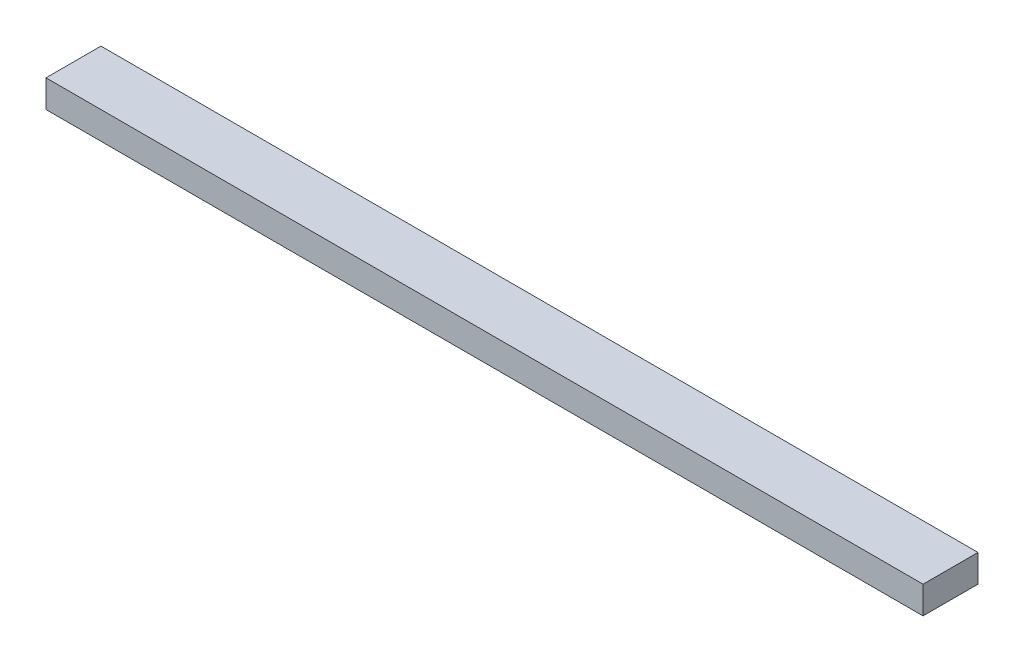
ISO-10303-21;
HEADER;
FILE_DESCRIPTION(('STEP AP214'),'2;1');
FILE_NAME('part.step','',(''),(''),'','','');
FILE_SCHEMA(('AUTOMOTIVE_DESIGN { 1 0 10303 214 1 1 1 1 }'));
ENDSEC;
DATA;
#1=APPLICATION_CONTEXT('core data for automotive mechanical design processes');
#2=APPLICATION_PROTOCOL_DEFINITION('international standard','automotive_design',2000,#1);
#3=PRODUCT_CONTEXT('',#1,'mechanical');
#4=PRODUCT('Part','Part','',(#3));
#5=PRODUCT_RELATED_PRODUCT_CATEGORY('part','',(#4));
#6=PRODUCT_DEFINITION_FORMATION('','',#4);
#7=PRODUCT_DEFINITION_CONTEXT('part definition',#1,'design');
#8=PRODUCT_DEFINITION('design','',#6,#7);
#9=PRODUCT_DEFINITION_SHAPE('','',#8);
#10=(LENGTH_UNIT() NAMED_UNIT(*) SI_UNIT(.MILLI.,.METRE.));
#11=(NAMED_UNIT(*) PLANE_ANGLE_UNIT() SI_UNIT($,.RADIAN.));
#12=(NAMED_UNIT(*) SI_UNIT($,.STERADIAN.) SOLID_ANGLE_UNIT());
#13=UNCERTAINTY_MEASURE_WITH_UNIT(LENGTH_MEASURE(1.E-05),#10,'distance_accuracy_value','');
#14=(GEOMETRIC_REPRESENTATION_CONTEXT(3) GLOBAL_UNCERTAINTY_ASSIGNED_CONTEXT((#13)) GLOBAL_UNIT_ASSIGNED_CONTEXT((#10,
#11,#12)) REPRESENTATION_CONTEXT('',''));
#15=CARTESIAN_POINT('',(0.,0.,0.));
#16=DIRECTION('',(0.,0.,1.));
#17=DIRECTION('',(1.,0.,0.));
#18=AXIS2_PLACEMENT_3D('',#15,#16,#17);
#19=CARTESIAN_POINT('',(0.,19.05,0.));
#20=DIRECTION('',(1.,0.,0.));
#21=DIRECTION('',(0.,0.,-1.));
#22=AXIS2_PLACEMENT_3D('',#19,#20,#21);
#23=PLANE('',#22);
#24=DIRECTION('',(0.,0.,1.));
#25=VECTOR('',#24,1.);
#26=CARTESIAN_POINT('',(0.,0.,0.));
#27=LINE('',#26,#25);
#28=CARTESIAN_POINT('',(0.,0.,-38.1));
#29=VERTEX_POINT('',#28);
#30=CARTESIAN_POINT('',(0.,0.,0.));
#31=VERTEX_POINT('',#30);
#32=EDGE_CURVE('E102',#29,#31,#27,.T.);
#33=ORIENTED_EDGE('',*,*,#32,.T.);
#34=DIRECTION('',(0.,-1.,0.));
#35=VECTOR('',#34,1.);
#36=CARTESIAN_POINT('',(0.,19.05,0.));
#37=LINE('',#36,#35);
#38=CARTESIAN_POINT('',(0.,19.05,0.));
#39=VERTEX_POINT('',#38);
#40=EDGE_CURVE('E11',#39,#31,#37,.T.);
#41=ORIENTED_EDGE('',*,*,#40,.F.);
#42=DIRECTION('',(0.,0.,1.));
#43=VECTOR('',#42,1.);
#44=CARTESIAN_POINT('',(0.,19.05,0.));
#45=LINE('',#44,#43);
#46=CARTESIAN_POINT('',(0.,19.05,-38.1));
#47=VERTEX_POINT('',#46);
#48=EDGE_CURVE('E90',#47,#39,#45,.T.);
#49=ORIENTED_EDGE('',*,*,#48,.F.);
#50=DIRECTION('',(0.,-1.,0.));
#51=VECTOR('',#50,1.);
#52=CARTESIAN_POINT('',(0.,19.05,-38.1));
#53=LINE('',#52,#51);
#54=EDGE_CURVE('E98',#47,#29,#53,.T.);
#55=ORIENTED_EDGE('',*,*,#54,.T.);
#56=EDGE_LOOP('',(#33,#41,#49,#55));
#57=FACE_BOUND('',#56,.T.);
#58=ADVANCED_FACE('F39',(#57),#23,.F.);
#59=CARTESIAN_POINT('',(0.,19.05,0.));
#60=DIRECTION('',(0.,0.,-1.));
#61=DIRECTION('',(-1.,0.,0.));
#62=AXIS2_PLACEMENT_3D('',#59,#60,#61);
#63=PLANE('',#62);
#64=DIRECTION('',(1.,0.,0.));
#65=VECTOR('',#64,1.);
#66=CARTESIAN_POINT('',(0.,0.,0.));
#67=LINE('',#66,#65);
#68=CARTESIAN_POINT('',(608.0125,0.,0.));
#69=VERTEX_POINT('',#68);
#70=EDGE_CURVE('E94',#31,#69,#67,.T.);
#71=ORIENTED_EDGE('',*,*,#70,.T.);
#72=DIRECTION('',(0.,-1.,0.));
#73=VECTOR('',#72,1.);
#74=CARTESIAN_POINT('',(608.0125,19.05,0.));
#75=LINE('',#74,#73);
#76=CARTESIAN_POINT('',(608.0125,19.05,0.));
#77=VERTEX_POINT('',#76);
#78=EDGE_CURVE('E47',#77,#69,#75,.T.);
#79=ORIENTED_EDGE('',*,*,#78,.F.);
#80=DIRECTION('',(1.,0.,0.));
#81=VECTOR('',#80,1.);
#82=CARTESIAN_POINT('',(0.,19.05,0.));
#83=LINE('',#82,#81);
#84=EDGE_CURVE('E85',#39,#77,#83,.T.);
#85=ORIENTED_EDGE('',*,*,#84,.F.);
#86=ORIENTED_EDGE('',*,*,#40,.T.);
#87=EDGE_LOOP('',(#71,#79,#85,#86));
#88=FACE_BOUND('',#87,.T.);
#89=ADVANCED_FACE('F93',(#88),#63,.F.);
#90=CARTESIAN_POINT('',(608.0125,19.05,0.));
#91=DIRECTION('',(-1.,0.,0.));
#92=DIRECTION('',(0.,0.,1.));
#93=AXIS2_PLACEMENT_3D('',#90,#91,#92);
#94=PLANE('',#93);
#95=DIRECTION('',(0.,0.,-1.));
#96=VECTOR('',#95,1.);
#97=CARTESIAN_POINT('',(608.0125,0.,0.));
#98=LINE('',#97,#96);
#99=CARTESIAN_POINT('',(608.0125,0.,-38.1));
#100=VERTEX_POINT('',#99);
#101=EDGE_CURVE('E72',#69,#100,#98,.T.);
#102=ORIENTED_EDGE('',*,*,#101,.T.);
#103=DIRECTION('',(0.,-1.,0.));
#104=VECTOR('',#103,1.);
#105=CARTESIAN_POINT('',(608.0125,19.05,-38.1));
#106=LINE('',#105,#104);
#107=CARTESIAN_POINT('',(608.0125,19.05,-38.1));
#108=VERTEX_POINT('',#107);
#109=EDGE_CURVE('E95',#108,#100,#106,.T.);
#110=ORIENTED_EDGE('',*,*,#109,.F.);
#111=DIRECTION('',(0.,0.,-1.));
#112=VECTOR('',#111,1.);
#113=CARTESIAN_POINT('',(608.0125,19.05,0.));
#114=LINE('',#113,#112);
#115=EDGE_CURVE('E88',#77,#108,#114,.T.);
#116=ORIENTED_EDGE('',*,*,#115,.F.);
#117=ORIENTED_EDGE('',*,*,#78,.T.);
#118=EDGE_LOOP('',(#102,#110,#116,#117));
#119=FACE_BOUND('',#118,.T.);
#120=ADVANCED_FACE('F96',(#119),#94,.F.);
#121=CARTESIAN_POINT('',(0.,19.05,-38.1));
#122=DIRECTION('',(0.,0.,1.));
#123=DIRECTION('',(1.,0.,0.));
#124=AXIS2_PLACEMENT_3D('',#121,#122,#123);
#125=PLANE('',#124);
#126=DIRECTION('',(-1.,0.,0.));
#127=VECTOR('',#126,1.);
#128=CARTESIAN_POINT('',(0.,0.,-38.1));
#129=LINE('',#128,#127);
#130=EDGE_CURVE('E78',#100,#29,#129,.T.);
#131=ORIENTED_EDGE('',*,*,#130,.T.);
#132=ORIENTED_EDGE('',*,*,#54,.F.);
#133=DIRECTION('',(-1.,0.,0.));
#134=VECTOR('',#133,1.);
#135=CARTESIAN_POINT('',(0.,19.05,-38.1));
#136=LINE('',#135,#134);
#137=EDGE_CURVE('E55',#108,#47,#136,.T.);
#138=ORIENTED_EDGE('',*,*,#137,.F.);
#139=ORIENTED_EDGE('',*,*,#109,.T.);
#140=EDGE_LOOP('',(#131,#132,#138,#139));
#141=FACE_BOUND('',#140,.T.);
#142=ADVANCED_FACE('F109',(#141),#125,.F.);
#143=CARTESIAN_POINT('',(0.,19.05,0.));
#144=DIRECTION('',(0.,-1.,0.));
#145=DIRECTION('',(0.,0.,-1.));
#146=AXIS2_PLACEMENT_3D('',#143,#144,#145);
#147=PLANE('',#146);
#148=ORIENTED_EDGE('',*,*,#48,.T.);
#149=ORIENTED_EDGE('',*,*,#84,.T.);
#150=ORIENTED_EDGE('',*,*,#115,.T.);
#151=ORIENTED_EDGE('',*,*,#137,.T.);
#152=EDGE_LOOP('',(#148,#149,#150,#151));
#153=FACE_BOUND('',#152,.T.);
#154=ADVANCED_FACE('F86',(#153),#147,.F.);
#155=CARTESIAN_POINT('',(0.,0.,0.));
#156=DIRECTION('',(0.,-1.,0.));
#157=DIRECTION('',(0.,0.,-1.));
#158=AXIS2_PLACEMENT_3D('',#155,#156,#157);
#159=PLANE('',#158);
#160=ORIENTED_EDGE('',*,*,#32,.F.);
#161=ORIENTED_EDGE('',*,*,#130,.F.);
#162=ORIENTED_EDGE('',*,*,#101,.F.);
#163=ORIENTED_EDGE('',*,*,#70,.F.);
#164=EDGE_LOOP('',(#160,#161,#162,#163));
#165=FACE_BOUND('',#164,.T.);
#166=ADVANCED_FACE('F112',(#165),#159,.T.);
#167=CLOSED_SHELL('',(#58,#89,#120,#142,#154,#166));
#168=MANIFOLD_SOLID_BREP('B2',#167);
#169=ADVANCED_BREP_SHAPE_REPRESENTATION('',(#18,#168),#14);
#170=SHAPE_DEFINITION_REPRESENTATION(#9,#169);
ENDSEC;
END-ISO-10303-21;
